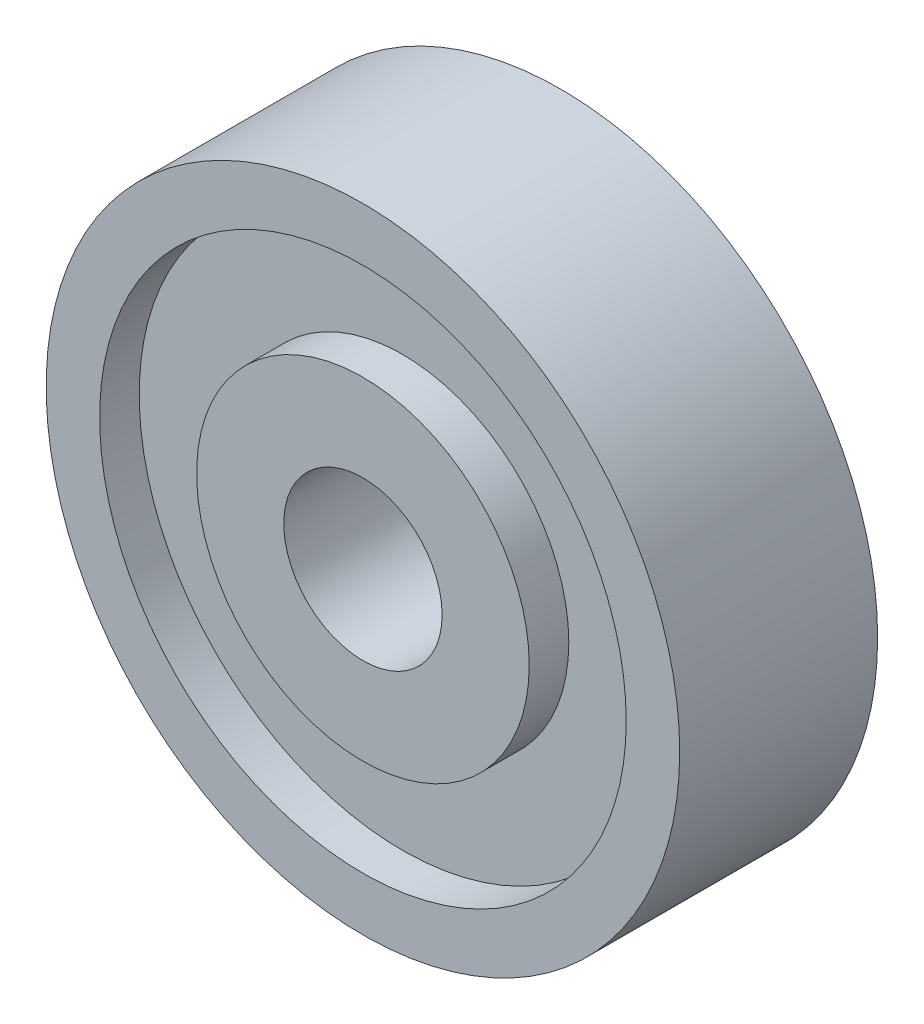
ISO-10303-21;
HEADER;
FILE_DESCRIPTION(('STEP AP214'),'2;1');
FILE_NAME('part.step','',(''),(''),'','','');
FILE_SCHEMA(('AUTOMOTIVE_DESIGN { 1 0 10303 214 1 1 1 1 }'));
ENDSEC;
DATA;
#1=APPLICATION_CONTEXT('core data for automotive mechanical design processes');
#2=APPLICATION_PROTOCOL_DEFINITION('international standard','automotive_design',2000,#1);
#3=PRODUCT_CONTEXT('',#1,'mechanical');
#4=PRODUCT('Part','Part','',(#3));
#5=PRODUCT_RELATED_PRODUCT_CATEGORY('part','',(#4));
#6=PRODUCT_DEFINITION_FORMATION('','',#4);
#7=PRODUCT_DEFINITION_CONTEXT('part definition',#1,'design');
#8=PRODUCT_DEFINITION('design','',#6,#7);
#9=PRODUCT_DEFINITION_SHAPE('','',#8);
#10=(LENGTH_UNIT() NAMED_UNIT(*) SI_UNIT(.MILLI.,.METRE.));
#11=(NAMED_UNIT(*) PLANE_ANGLE_UNIT() SI_UNIT($,.RADIAN.));
#12=(NAMED_UNIT(*) SI_UNIT($,.STERADIAN.) SOLID_ANGLE_UNIT());
#13=UNCERTAINTY_MEASURE_WITH_UNIT(LENGTH_MEASURE(1.E-05),#10,'distance_accuracy_value','');
#14=(GEOMETRIC_REPRESENTATION_CONTEXT(3) GLOBAL_UNCERTAINTY_ASSIGNED_CONTEXT((#13)) GLOBAL_UNIT_ASSIGNED_CONTEXT((#10,
#11,#12)) REPRESENTATION_CONTEXT('',''));
#15=CARTESIAN_POINT('',(0.,0.,0.));
#16=DIRECTION('',(0.,0.,1.));
#17=DIRECTION('',(1.,0.,0.));
#18=AXIS2_PLACEMENT_3D('',#15,#16,#17);
#19=CARTESIAN_POINT('',(0.,0.,0.));
#20=DIRECTION('',(0.,0.,1.));
#21=DIRECTION('',(1.,0.,0.));
#22=AXIS2_PLACEMENT_3D('',#19,#20,#21);
#23=PLANE('',#22);
#24=CARTESIAN_POINT('',(0.,0.,0.));
#25=DIRECTION('',(0.,0.,1.));
#26=DIRECTION('',(1.,0.,0.));
#27=AXIS2_PLACEMENT_3D('',#24,#25,#26);
#28=CIRCLE('',#27,8.);
#29=CARTESIAN_POINT('',(8.,0.,0.));
#30=VERTEX_POINT('',#29);
#31=EDGE_CURVE('E35',#30,#30,#28,.T.);
#32=ORIENTED_EDGE('',*,*,#31,.F.);
#33=EDGE_LOOP('',(#32));
#34=FACE_BOUND('',#33,.T.);
#35=CARTESIAN_POINT('',(0.,0.,0.));
#36=DIRECTION('',(0.,0.,1.));
#37=DIRECTION('',(1.,0.,0.));
#38=AXIS2_PLACEMENT_3D('',#35,#36,#37);
#39=CIRCLE('',#38,6.65);
#40=CARTESIAN_POINT('',(6.65,0.,0.));
#41=VERTEX_POINT('',#40);
#42=EDGE_CURVE('E62',#41,#41,#39,.T.);
#43=ORIENTED_EDGE('',*,*,#42,.T.);
#44=EDGE_LOOP('',(#43));
#45=FACE_BOUND('',#44,.T.);
#46=ADVANCED_FACE('F31',(#34,#45),#23,.F.);
#47=CARTESIAN_POINT('',(0.,0.,5.));
#48=DIRECTION('',(0.,0.,1.));
#49=DIRECTION('',(1.,0.,0.));
#50=AXIS2_PLACEMENT_3D('',#47,#48,#49);
#51=PLANE('',#50);
#52=CARTESIAN_POINT('',(0.,0.,5.));
#53=DIRECTION('',(0.,0.,1.));
#54=DIRECTION('',(1.,0.,0.));
#55=AXIS2_PLACEMENT_3D('',#52,#53,#54);
#56=CIRCLE('',#55,2.);
#57=CARTESIAN_POINT('',(2.,0.,5.));
#58=VERTEX_POINT('',#57);
#59=EDGE_CURVE('E42',#58,#58,#56,.T.);
#60=ORIENTED_EDGE('',*,*,#59,.F.);
#61=EDGE_LOOP('',(#60));
#62=FACE_BOUND('',#61,.T.);
#63=CARTESIAN_POINT('',(0.,0.,5.));
#64=DIRECTION('',(0.,0.,1.));
#65=DIRECTION('',(1.,0.,0.));
#66=AXIS2_PLACEMENT_3D('',#63,#64,#65);
#67=CIRCLE('',#66,4.2);
#68=CARTESIAN_POINT('',(4.2,0.,5.));
#69=VERTEX_POINT('',#68);
#70=EDGE_CURVE('E56',#69,#69,#67,.T.);
#71=ORIENTED_EDGE('',*,*,#70,.T.);
#72=EDGE_LOOP('',(#71));
#73=FACE_BOUND('',#72,.T.);
#74=ADVANCED_FACE('F104',(#62,#73),#51,.T.);
#75=CARTESIAN_POINT('',(0.,0.,5.));
#76=DIRECTION('',(0.,0.,1.));
#77=DIRECTION('',(1.,0.,0.));
#78=AXIS2_PLACEMENT_3D('',#75,#76,#77);
#79=CIRCLE('',#78,6.65);
#80=CARTESIAN_POINT('',(6.65,0.,5.));
#81=VERTEX_POINT('',#80);
#82=EDGE_CURVE('E50',#81,#81,#79,.T.);
#83=ORIENTED_EDGE('',*,*,#82,.F.);
#84=EDGE_LOOP('',(#83));
#85=FACE_BOUND('',#84,.T.);
#86=CARTESIAN_POINT('',(0.,0.,5.));
#87=DIRECTION('',(0.,0.,1.));
#88=DIRECTION('',(1.,0.,0.));
#89=AXIS2_PLACEMENT_3D('',#86,#87,#88);
#90=CIRCLE('',#89,8.);
#91=CARTESIAN_POINT('',(8.,0.,5.));
#92=VERTEX_POINT('',#91);
#93=EDGE_CURVE('E10',#92,#92,#90,.T.);
#94=ORIENTED_EDGE('',*,*,#93,.T.);
#95=EDGE_LOOP('',(#94));
#96=FACE_BOUND('',#95,.T.);
#97=ADVANCED_FACE('F86',(#85,#96),#51,.T.);
#98=CARTESIAN_POINT('',(0.,0.,0.));
#99=DIRECTION('',(0.,0.,1.));
#100=DIRECTION('',(1.,0.,0.));
#101=AXIS2_PLACEMENT_3D('',#98,#99,#100);
#102=CIRCLE('',#101,4.2);
#103=CARTESIAN_POINT('',(4.2,0.,0.));
#104=VERTEX_POINT('',#103);
#105=EDGE_CURVE('E68',#104,#104,#102,.T.);
#106=ORIENTED_EDGE('',*,*,#105,.F.);
#107=EDGE_LOOP('',(#106));
#108=FACE_BOUND('',#107,.T.);
#109=CARTESIAN_POINT('',(0.,0.,0.));
#110=DIRECTION('',(0.,0.,1.));
#111=DIRECTION('',(1.,0.,0.));
#112=AXIS2_PLACEMENT_3D('',#109,#110,#111);
#113=CIRCLE('',#112,2.);
#114=CARTESIAN_POINT('',(2.,0.,0.));
#115=VERTEX_POINT('',#114);
#116=EDGE_CURVE('E44',#115,#115,#113,.T.);
#117=ORIENTED_EDGE('',*,*,#116,.T.);
#118=EDGE_LOOP('',(#117));
#119=FACE_BOUND('',#118,.T.);
#120=ADVANCED_FACE('F83',(#108,#119),#23,.F.);
#121=CARTESIAN_POINT('',(0.,0.,5.));
#122=DIRECTION('',(0.,0.,-1.));
#123=DIRECTION('',(-1.,0.,0.));
#124=AXIS2_PLACEMENT_3D('',#121,#122,#123);
#125=CYLINDRICAL_SURFACE('',#124,8.);
#126=ORIENTED_EDGE('',*,*,#93,.F.);
#127=EDGE_LOOP('',(#126));
#128=FACE_BOUND('',#127,.T.);
#129=ORIENTED_EDGE('',*,*,#31,.T.);
#130=EDGE_LOOP('',(#129));
#131=FACE_BOUND('',#130,.T.);
#132=ADVANCED_FACE('F33',(#128,#131),#125,.T.);
#133=CARTESIAN_POINT('',(0.,0.,5.));
#134=DIRECTION('',(0.,0.,-1.));
#135=DIRECTION('',(-1.,0.,0.));
#136=AXIS2_PLACEMENT_3D('',#133,#134,#135);
#137=CYLINDRICAL_SURFACE('',#136,2.);
#138=ORIENTED_EDGE('',*,*,#59,.T.);
#139=EDGE_LOOP('',(#138));
#140=FACE_BOUND('',#139,.T.);
#141=ORIENTED_EDGE('',*,*,#116,.F.);
#142=EDGE_LOOP('',(#141));
#143=FACE_BOUND('',#142,.T.);
#144=ADVANCED_FACE('F89',(#140,#143),#137,.F.);
#145=CARTESIAN_POINT('',(0.,0.,4.));
#146=DIRECTION('',(0.,0.,1.));
#147=DIRECTION('',(1.,0.,0.));
#148=AXIS2_PLACEMENT_3D('',#145,#146,#147);
#149=CYLINDRICAL_SURFACE('',#148,6.65);
#150=CARTESIAN_POINT('',(0.,0.,4.));
#151=DIRECTION('',(0.,0.,1.));
#152=DIRECTION('',(1.,0.,0.));
#153=AXIS2_PLACEMENT_3D('',#150,#151,#152);
#154=CIRCLE('',#153,6.65);
#155=CARTESIAN_POINT('',(6.65,0.,4.));
#156=VERTEX_POINT('',#155);
#157=EDGE_CURVE('E47',#156,#156,#154,.T.);
#158=ORIENTED_EDGE('',*,*,#157,.F.);
#159=EDGE_LOOP('',(#158));
#160=FACE_BOUND('',#159,.T.);
#161=ORIENTED_EDGE('',*,*,#82,.T.);
#162=EDGE_LOOP('',(#161));
#163=FACE_BOUND('',#162,.T.);
#164=ADVANCED_FACE('F91',(#160,#163),#149,.F.);
#165=CARTESIAN_POINT('',(0.,0.,4.));
#166=DIRECTION('',(0.,0.,1.));
#167=DIRECTION('',(1.,0.,0.));
#168=AXIS2_PLACEMENT_3D('',#165,#166,#167);
#169=PLANE('',#168);
#170=CARTESIAN_POINT('',(0.,0.,4.));
#171=DIRECTION('',(0.,0.,1.));
#172=DIRECTION('',(1.,0.,0.));
#173=AXIS2_PLACEMENT_3D('',#170,#171,#172);
#174=CIRCLE('',#173,4.2);
#175=CARTESIAN_POINT('',(4.2,0.,4.));
#176=VERTEX_POINT('',#175);
#177=EDGE_CURVE('E53',#176,#176,#174,.T.);
#178=ORIENTED_EDGE('',*,*,#177,.F.);
#179=EDGE_LOOP('',(#178));
#180=FACE_BOUND('',#179,.T.);
#181=ORIENTED_EDGE('',*,*,#157,.T.);
#182=EDGE_LOOP('',(#181));
#183=FACE_BOUND('',#182,.T.);
#184=ADVANCED_FACE('F98',(#180,#183),#169,.T.);
#185=CARTESIAN_POINT('',(0.,0.,4.));
#186=DIRECTION('',(0.,0.,1.));
#187=DIRECTION('',(1.,0.,0.));
#188=AXIS2_PLACEMENT_3D('',#185,#186,#187);
#189=CYLINDRICAL_SURFACE('',#188,4.2);
#190=ORIENTED_EDGE('',*,*,#177,.T.);
#191=EDGE_LOOP('',(#190));
#192=FACE_BOUND('',#191,.T.);
#193=ORIENTED_EDGE('',*,*,#70,.F.);
#194=EDGE_LOOP('',(#193));
#195=FACE_BOUND('',#194,.T.);
#196=ADVANCED_FACE('F152',(#192,#195),#189,.T.);
#197=CARTESIAN_POINT('',(0.,0.,1.));
#198=DIRECTION('',(0.,0.,-1.));
#199=DIRECTION('',(1.,0.,0.));
#200=AXIS2_PLACEMENT_3D('',#197,#198,#199);
#201=PLANE('',#200);
#202=CARTESIAN_POINT('',(0.,0.,1.));
#203=DIRECTION('',(0.,0.,1.));
#204=DIRECTION('',(1.,0.,0.));
#205=AXIS2_PLACEMENT_3D('',#202,#203,#204);
#206=CIRCLE('',#205,6.65);
#207=CARTESIAN_POINT('',(6.65,0.,1.));
#208=VERTEX_POINT('',#207);
#209=EDGE_CURVE('E59',#208,#208,#206,.T.);
#210=ORIENTED_EDGE('',*,*,#209,.F.);
#211=EDGE_LOOP('',(#210));
#212=FACE_BOUND('',#211,.T.);
#213=CARTESIAN_POINT('',(0.,0.,1.));
#214=DIRECTION('',(0.,0.,1.));
#215=DIRECTION('',(1.,0.,0.));
#216=AXIS2_PLACEMENT_3D('',#213,#214,#215);
#217=CIRCLE('',#216,4.2);
#218=CARTESIAN_POINT('',(4.2,0.,1.));
#219=VERTEX_POINT('',#218);
#220=EDGE_CURVE('E65',#219,#219,#217,.T.);
#221=ORIENTED_EDGE('',*,*,#220,.T.);
#222=EDGE_LOOP('',(#221));
#223=FACE_BOUND('',#222,.T.);
#224=ADVANCED_FACE('F74',(#212,#223),#201,.T.);
#225=CARTESIAN_POINT('',(0.,0.,1.));
#226=DIRECTION('',(0.,0.,-1.));
#227=DIRECTION('',(-1.,0.,0.));
#228=AXIS2_PLACEMENT_3D('',#225,#226,#227);
#229=CYLINDRICAL_SURFACE('',#228,6.65);
#230=ORIENTED_EDGE('',*,*,#209,.T.);
#231=EDGE_LOOP('',(#230));
#232=FACE_BOUND('',#231,.T.);
#233=ORIENTED_EDGE('',*,*,#42,.F.);
#234=EDGE_LOOP('',(#233));
#235=FACE_BOUND('',#234,.T.);
#236=ADVANCED_FACE('F79',(#232,#235),#229,.F.);
#237=CARTESIAN_POINT('',(0.,0.,1.));
#238=DIRECTION('',(0.,0.,-1.));
#239=DIRECTION('',(-1.,0.,0.));
#240=AXIS2_PLACEMENT_3D('',#237,#238,#239);
#241=CYLINDRICAL_SURFACE('',#240,4.2);
#242=ORIENTED_EDGE('',*,*,#220,.F.);
#243=EDGE_LOOP('',(#242));
#244=FACE_BOUND('',#243,.T.);
#245=ORIENTED_EDGE('',*,*,#105,.T.);
#246=EDGE_LOOP('',(#245));
#247=FACE_BOUND('',#246,.T.);
#248=ADVANCED_FACE('F76',(#244,#247),#241,.T.);
#249=CLOSED_SHELL('',(#46,#74,#97,#120,#132,#144,#164,#184,#196,#224,#236,#248));
#250=MANIFOLD_SOLID_BREP('B2',#249);
#251=ADVANCED_BREP_SHAPE_REPRESENTATION('',(#18,#250),#14);
#252=SHAPE_DEFINITION_REPRESENTATION(#9,#251);
ENDSEC;
END-ISO-10303-21;
